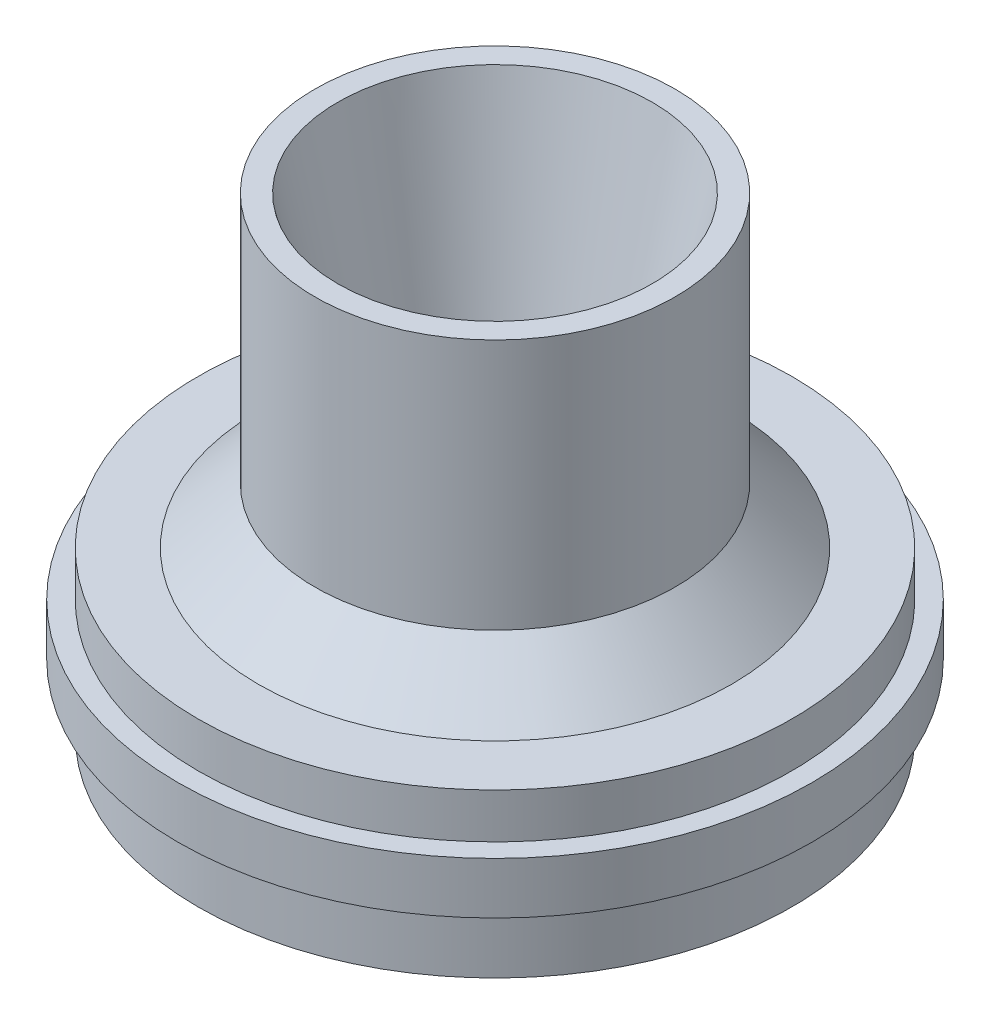
ISO-10303-21;
HEADER;
FILE_DESCRIPTION(('STEP AP214'),'2;1');
FILE_NAME('part.step','',(''),(''),'','','');
FILE_SCHEMA(('AUTOMOTIVE_DESIGN { 1 0 10303 214 1 1 1 1 }'));
ENDSEC;
DATA;
#1=APPLICATION_CONTEXT('core data for automotive mechanical design processes');
#2=APPLICATION_PROTOCOL_DEFINITION('international standard','automotive_design',2000,#1);
#3=PRODUCT_CONTEXT('',#1,'mechanical');
#4=PRODUCT('Part','Part','',(#3));
#5=PRODUCT_RELATED_PRODUCT_CATEGORY('part','',(#4));
#6=PRODUCT_DEFINITION_FORMATION('','',#4);
#7=PRODUCT_DEFINITION_CONTEXT('part definition',#1,'design');
#8=PRODUCT_DEFINITION('design','',#6,#7);
#9=PRODUCT_DEFINITION_SHAPE('','',#8);
#10=(LENGTH_UNIT() NAMED_UNIT(*) SI_UNIT(.MILLI.,.METRE.));
#11=(NAMED_UNIT(*) PLANE_ANGLE_UNIT() SI_UNIT($,.RADIAN.));
#12=(NAMED_UNIT(*) SI_UNIT($,.STERADIAN.) SOLID_ANGLE_UNIT());
#13=UNCERTAINTY_MEASURE_WITH_UNIT(LENGTH_MEASURE(1.E-05),#10,'distance_accuracy_value','');
#14=(GEOMETRIC_REPRESENTATION_CONTEXT(3) GLOBAL_UNCERTAINTY_ASSIGNED_CONTEXT((#13)) GLOBAL_UNIT_ASSIGNED_CONTEXT((#10,
#11,#12)) REPRESENTATION_CONTEXT('',''));
#15=CARTESIAN_POINT('',(0.,0.,0.));
#16=DIRECTION('',(0.,0.,1.));
#17=DIRECTION('',(1.,0.,0.));
#18=AXIS2_PLACEMENT_3D('',#15,#16,#17);
#19=CARTESIAN_POINT('',(0.,0.,0.));
#20=DIRECTION('',(0.,-1.,0.));
#21=DIRECTION('',(0.,0.,-1.));
#22=AXIS2_PLACEMENT_3D('',#19,#20,#21);
#23=CYLINDRICAL_SURFACE('',#22,42.926);
#24=CARTESIAN_POINT('',(0.,-42.5704,0.));
#25=DIRECTION('',(0.,-1.,0.));
#26=DIRECTION('',(0.,0.,-1.));
#27=AXIS2_PLACEMENT_3D('',#24,#25,#26);
#28=CIRCLE('',#27,42.926);
#29=CARTESIAN_POINT('',(0.,-42.5704,-42.926));
#30=VERTEX_POINT('',#29);
#31=EDGE_CURVE('E10',#30,#30,#28,.T.);
#32=ORIENTED_EDGE('',*,*,#31,.F.);
#33=EDGE_LOOP('',(#32));
#34=FACE_BOUND('',#33,.T.);
#35=CARTESIAN_POINT('',(0.,-32.9946,0.));
#36=DIRECTION('',(0.,-1.,0.));
#37=DIRECTION('',(0.,0.,-1.));
#38=AXIS2_PLACEMENT_3D('',#35,#36,#37);
#39=CIRCLE('',#38,42.926);
#40=CARTESIAN_POINT('',(0.,-32.9946,-42.926));
#41=VERTEX_POINT('',#40);
#42=EDGE_CURVE('E75',#41,#41,#39,.T.);
#43=ORIENTED_EDGE('',*,*,#42,.T.);
#44=EDGE_LOOP('',(#43));
#45=FACE_BOUND('',#44,.T.);
#46=ADVANCED_FACE('F32',(#34,#45),#23,.T.);
#47=CARTESIAN_POINT('',(-40.513,-42.5704,0.));
#48=DIRECTION('',(0.,1.,0.));
#49=DIRECTION('',(0.,0.,1.));
#50=AXIS2_PLACEMENT_3D('',#47,#48,#49);
#51=PLANE('',#50);
#52=CARTESIAN_POINT('',(0.,-42.5704,0.));
#53=DIRECTION('',(0.,-1.,0.));
#54=DIRECTION('',(0.,0.,-1.));
#55=AXIS2_PLACEMENT_3D('',#52,#53,#54);
#56=CIRCLE('',#55,40.513);
#57=CARTESIAN_POINT('',(0.,-42.5704,-40.513));
#58=VERTEX_POINT('',#57);
#59=EDGE_CURVE('E38',#58,#58,#56,.T.);
#60=ORIENTED_EDGE('',*,*,#59,.F.);
#61=EDGE_LOOP('',(#60));
#62=FACE_BOUND('',#61,.T.);
#63=ORIENTED_EDGE('',*,*,#31,.T.);
#64=EDGE_LOOP('',(#63));
#65=FACE_BOUND('',#64,.T.);
#66=ADVANCED_FACE('F142',(#62,#65),#51,.F.);
#67=CARTESIAN_POINT('',(0.,-42.5704,0.));
#68=DIRECTION('',(0.,-1.,0.));
#69=DIRECTION('',(0.,0.,-1.));
#70=AXIS2_PLACEMENT_3D('',#67,#68,#69);
#71=CONICAL_SURFACE('',#70,40.513,1.11244567922555);
#72=CARTESIAN_POINT('',(0.,-29.2862,0.));
#73=DIRECTION('',(0.,-1.,0.));
#74=DIRECTION('',(0.,0.,-1.));
#75=AXIS2_PLACEMENT_3D('',#72,#73,#74);
#76=CIRCLE('',#75,13.589);
#77=CARTESIAN_POINT('',(0.,-29.2862,-13.589));
#78=VERTEX_POINT('',#77);
#79=EDGE_CURVE('E42',#78,#78,#76,.T.);
#80=ORIENTED_EDGE('',*,*,#79,.F.);
#81=EDGE_LOOP('',(#80));
#82=FACE_BOUND('',#81,.T.);
#83=ORIENTED_EDGE('',*,*,#59,.T.);
#84=EDGE_LOOP('',(#83));
#85=FACE_BOUND('',#84,.T.);
#86=ADVANCED_FACE('F137',(#82,#85),#71,.F.);
#87=CARTESIAN_POINT('',(0.,0.,0.));
#88=DIRECTION('',(0.,-1.,0.));
#89=DIRECTION('',(0.,0.,-1.));
#90=AXIS2_PLACEMENT_3D('',#87,#88,#89);
#91=CYLINDRICAL_SURFACE('',#90,13.589);
#92=CARTESIAN_POINT('',(0.,-17.3482,0.));
#93=DIRECTION('',(0.,-1.,0.));
#94=DIRECTION('',(0.,0.,-1.));
#95=AXIS2_PLACEMENT_3D('',#92,#93,#94);
#96=CIRCLE('',#95,13.589);
#97=CARTESIAN_POINT('',(0.,-17.3482,-13.589));
#98=VERTEX_POINT('',#97);
#99=EDGE_CURVE('E46',#98,#98,#96,.T.);
#100=ORIENTED_EDGE('',*,*,#99,.F.);
#101=EDGE_LOOP('',(#100));
#102=FACE_BOUND('',#101,.T.);
#103=ORIENTED_EDGE('',*,*,#79,.T.);
#104=EDGE_LOOP('',(#103));
#105=FACE_BOUND('',#104,.T.);
#106=ADVANCED_FACE('F131',(#102,#105),#91,.F.);
#107=CARTESIAN_POINT('',(0.,-17.3482,0.));
#108=DIRECTION('',(0.,1.,0.));
#109=DIRECTION('',(0.,0.,1.));
#110=AXIS2_PLACEMENT_3D('',#107,#108,#109);
#111=CONICAL_SURFACE('',#110,13.589,0.211012175919782);
#112=CARTESIAN_POINT('',(0.,25.4,0.));
#113=DIRECTION('',(0.,-1.,0.));
#114=DIRECTION('',(0.,0.,-1.));
#115=AXIS2_PLACEMENT_3D('',#112,#113,#114);
#116=CIRCLE('',#115,22.7457);
#117=CARTESIAN_POINT('',(0.,25.4,-22.7457));
#118=VERTEX_POINT('',#117);
#119=EDGE_CURVE('E51',#118,#118,#116,.T.);
#120=ORIENTED_EDGE('',*,*,#119,.F.);
#121=EDGE_LOOP('',(#120));
#122=FACE_BOUND('',#121,.T.);
#123=ORIENTED_EDGE('',*,*,#99,.T.);
#124=EDGE_LOOP('',(#123));
#125=FACE_BOUND('',#124,.T.);
#126=ADVANCED_FACE('F125',(#122,#125),#111,.F.);
#127=CARTESIAN_POINT('',(-26.0477,25.4,0.));
#128=DIRECTION('',(0.,-1.,0.));
#129=DIRECTION('',(0.,0.,-1.));
#130=AXIS2_PLACEMENT_3D('',#127,#128,#129);
#131=PLANE('',#130);
#132=CARTESIAN_POINT('',(0.,25.4,0.));
#133=DIRECTION('',(0.,-1.,0.));
#134=DIRECTION('',(0.,0.,-1.));
#135=AXIS2_PLACEMENT_3D('',#132,#133,#134);
#136=CIRCLE('',#135,26.0477);
#137=CARTESIAN_POINT('',(0.,25.4,-26.0477));
#138=VERTEX_POINT('',#137);
#139=EDGE_CURVE('E54',#138,#138,#136,.T.);
#140=ORIENTED_EDGE('',*,*,#139,.F.);
#141=EDGE_LOOP('',(#140));
#142=FACE_BOUND('',#141,.T.);
#143=ORIENTED_EDGE('',*,*,#119,.T.);
#144=EDGE_LOOP('',(#143));
#145=FACE_BOUND('',#144,.T.);
#146=ADVANCED_FACE('F119',(#142,#145),#131,.F.);
#147=CARTESIAN_POINT('',(0.,0.,0.));
#148=DIRECTION('',(0.,-1.,0.));
#149=DIRECTION('',(0.,0.,-1.));
#150=AXIS2_PLACEMENT_3D('',#147,#148,#149);
#151=CYLINDRICAL_SURFACE('',#150,26.0477);
#152=CARTESIAN_POINT('',(0.,-10.9474,0.));
#153=DIRECTION('',(0.,-1.,0.));
#154=DIRECTION('',(0.,0.,-1.));
#155=AXIS2_PLACEMENT_3D('',#152,#153,#154);
#156=CIRCLE('',#155,26.0477);
#157=CARTESIAN_POINT('',(0.,-10.9474,-26.0477));
#158=VERTEX_POINT('',#157);
#159=EDGE_CURVE('E57',#158,#158,#156,.T.);
#160=ORIENTED_EDGE('',*,*,#159,.F.);
#161=EDGE_LOOP('',(#160));
#162=FACE_BOUND('',#161,.T.);
#163=ORIENTED_EDGE('',*,*,#139,.T.);
#164=EDGE_LOOP('',(#163));
#165=FACE_BOUND('',#164,.T.);
#166=ADVANCED_FACE('F113',(#162,#165),#151,.T.);
#167=CARTESIAN_POINT('',(0.,-10.9474,0.));
#168=DIRECTION('',(0.,-1.,0.));
#169=DIRECTION('',(0.,0.,-1.));
#170=AXIS2_PLACEMENT_3D('',#167,#168,#169);
#171=CONICAL_SURFACE('',#170,26.0477,0.791648082019147);
#172=CARTESIAN_POINT('',(0.,-19.0246,0.));
#173=DIRECTION('',(0.,-1.,0.));
#174=DIRECTION('',(0.,0.,-1.));
#175=AXIS2_PLACEMENT_3D('',#172,#173,#174);
#176=CIRCLE('',#175,34.2265);
#177=CARTESIAN_POINT('',(0.,-19.0246,-34.2265));
#178=VERTEX_POINT('',#177);
#179=EDGE_CURVE('E60',#178,#178,#176,.T.);
#180=ORIENTED_EDGE('',*,*,#179,.F.);
#181=EDGE_LOOP('',(#180));
#182=FACE_BOUND('',#181,.T.);
#183=ORIENTED_EDGE('',*,*,#159,.T.);
#184=EDGE_LOOP('',(#183));
#185=FACE_BOUND('',#184,.T.);
#186=ADVANCED_FACE('F107',(#182,#185),#171,.T.);
#187=CARTESIAN_POINT('',(-42.926,-19.0246,0.));
#188=DIRECTION('',(0.,-1.,0.));
#189=DIRECTION('',(0.,0.,-1.));
#190=AXIS2_PLACEMENT_3D('',#187,#188,#189);
#191=PLANE('',#190);
#192=CARTESIAN_POINT('',(0.,-19.0246,0.));
#193=DIRECTION('',(0.,-1.,0.));
#194=DIRECTION('',(0.,0.,-1.));
#195=AXIS2_PLACEMENT_3D('',#192,#193,#194);
#196=CIRCLE('',#195,42.926);
#197=CARTESIAN_POINT('',(0.,-19.0246,-42.926));
#198=VERTEX_POINT('',#197);
#199=EDGE_CURVE('E63',#198,#198,#196,.T.);
#200=ORIENTED_EDGE('',*,*,#199,.F.);
#201=EDGE_LOOP('',(#200));
#202=FACE_BOUND('',#201,.T.);
#203=ORIENTED_EDGE('',*,*,#179,.T.);
#204=EDGE_LOOP('',(#203));
#205=FACE_BOUND('',#204,.T.);
#206=ADVANCED_FACE('F101',(#202,#205),#191,.F.);
#207=CARTESIAN_POINT('',(0.,0.,0.));
#208=DIRECTION('',(0.,-1.,0.));
#209=DIRECTION('',(0.,0.,-1.));
#210=AXIS2_PLACEMENT_3D('',#207,#208,#209);
#211=CYLINDRICAL_SURFACE('',#210,42.926);
#212=CARTESIAN_POINT('',(0.,-25.527,0.));
#213=DIRECTION('',(0.,-1.,0.));
#214=DIRECTION('',(0.,0.,-1.));
#215=AXIS2_PLACEMENT_3D('',#212,#213,#214);
#216=CIRCLE('',#215,42.926);
#217=CARTESIAN_POINT('',(0.,-25.527,-42.926));
#218=VERTEX_POINT('',#217);
#219=EDGE_CURVE('E66',#218,#218,#216,.T.);
#220=ORIENTED_EDGE('',*,*,#219,.F.);
#221=EDGE_LOOP('',(#220));
#222=FACE_BOUND('',#221,.T.);
#223=ORIENTED_EDGE('',*,*,#199,.T.);
#224=EDGE_LOOP('',(#223));
#225=FACE_BOUND('',#224,.T.);
#226=ADVANCED_FACE('F95',(#222,#225),#211,.T.);
#227=CARTESIAN_POINT('',(-45.847,-25.527,0.));
#228=DIRECTION('',(0.,-1.,0.));
#229=DIRECTION('',(0.,0.,-1.));
#230=AXIS2_PLACEMENT_3D('',#227,#228,#229);
#231=PLANE('',#230);
#232=CARTESIAN_POINT('',(0.,-25.527,0.));
#233=DIRECTION('',(0.,-1.,0.));
#234=DIRECTION('',(0.,0.,-1.));
#235=AXIS2_PLACEMENT_3D('',#232,#233,#234);
#236=CIRCLE('',#235,45.847);
#237=CARTESIAN_POINT('',(0.,-25.527,-45.847));
#238=VERTEX_POINT('',#237);
#239=EDGE_CURVE('E69',#238,#238,#236,.T.);
#240=ORIENTED_EDGE('',*,*,#239,.F.);
#241=EDGE_LOOP('',(#240));
#242=FACE_BOUND('',#241,.T.);
#243=ORIENTED_EDGE('',*,*,#219,.T.);
#244=EDGE_LOOP('',(#243));
#245=FACE_BOUND('',#244,.T.);
#246=ADVANCED_FACE('F89',(#242,#245),#231,.F.);
#247=CARTESIAN_POINT('',(0.,0.,0.));
#248=DIRECTION('',(0.,-1.,0.));
#249=DIRECTION('',(0.,0.,-1.));
#250=AXIS2_PLACEMENT_3D('',#247,#248,#249);
#251=CYLINDRICAL_SURFACE('',#250,45.847);
#252=CARTESIAN_POINT('',(0.,-32.9946,0.));
#253=DIRECTION('',(0.,-1.,0.));
#254=DIRECTION('',(0.,0.,-1.));
#255=AXIS2_PLACEMENT_3D('',#252,#253,#254);
#256=CIRCLE('',#255,45.847);
#257=CARTESIAN_POINT('',(0.,-32.9946,-45.847));
#258=VERTEX_POINT('',#257);
#259=EDGE_CURVE('E72',#258,#258,#256,.T.);
#260=ORIENTED_EDGE('',*,*,#259,.F.);
#261=EDGE_LOOP('',(#260));
#262=FACE_BOUND('',#261,.T.);
#263=ORIENTED_EDGE('',*,*,#239,.T.);
#264=EDGE_LOOP('',(#263));
#265=FACE_BOUND('',#264,.T.);
#266=ADVANCED_FACE('F83',(#262,#265),#251,.T.);
#267=CARTESIAN_POINT('',(-42.926,-32.9946,0.));
#268=DIRECTION('',(0.,1.,0.));
#269=DIRECTION('',(0.,0.,1.));
#270=AXIS2_PLACEMENT_3D('',#267,#268,#269);
#271=PLANE('',#270);
#272=ORIENTED_EDGE('',*,*,#42,.F.);
#273=EDGE_LOOP('',(#272));
#274=FACE_BOUND('',#273,.T.);
#275=ORIENTED_EDGE('',*,*,#259,.T.);
#276=EDGE_LOOP('',(#275));
#277=FACE_BOUND('',#276,.T.);
#278=ADVANCED_FACE('F80',(#274,#277),#271,.F.);
#279=CLOSED_SHELL('',(#46,#66,#86,#106,#126,#146,#166,#186,#206,#226,#246,#266,#278));
#280=MANIFOLD_SOLID_BREP('B2',#279);
#281=ADVANCED_BREP_SHAPE_REPRESENTATION('',(#18,#280),#14);
#282=SHAPE_DEFINITION_REPRESENTATION(#9,#281);
ENDSEC;
END-ISO-10303-21;
